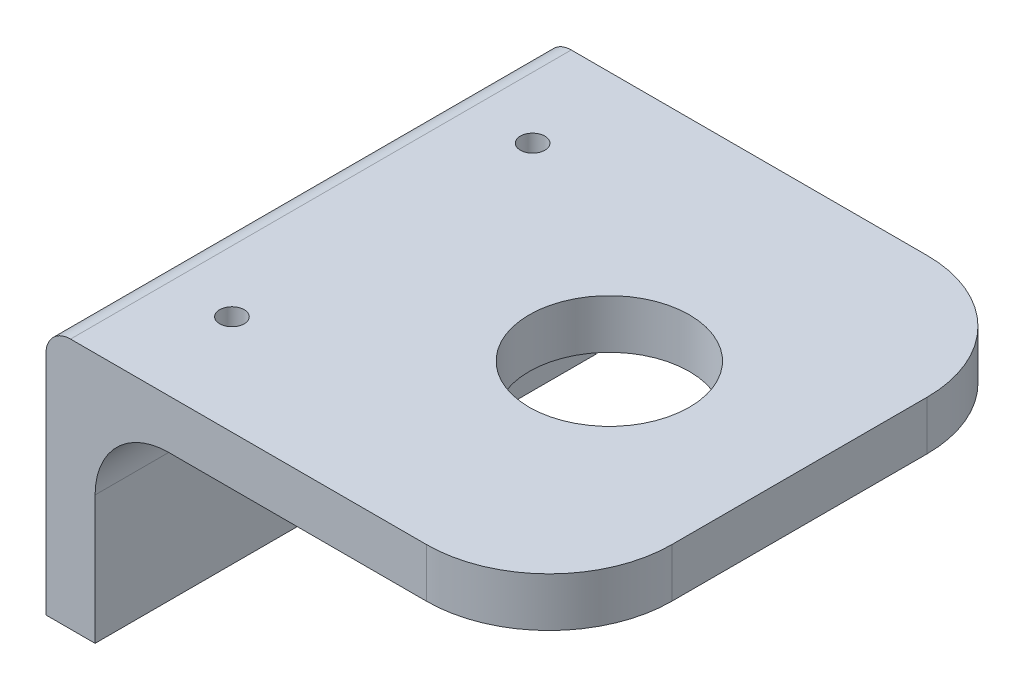
ISO-10303-21;
HEADER;
FILE_DESCRIPTION(('STEP AP214'),'2;1');
FILE_NAME('part.step','',(''),(''),'','','');
FILE_SCHEMA(('AUTOMOTIVE_DESIGN { 1 0 10303 214 1 1 1 1 }'));
ENDSEC;
DATA;
#1=APPLICATION_CONTEXT('core data for automotive mechanical design processes');
#2=APPLICATION_PROTOCOL_DEFINITION('international standard','automotive_design',2000,#1);
#3=PRODUCT_CONTEXT('',#1,'mechanical');
#4=PRODUCT('Part','Part','',(#3));
#5=PRODUCT_RELATED_PRODUCT_CATEGORY('part','',(#4));
#6=PRODUCT_DEFINITION_FORMATION('','',#4);
#7=PRODUCT_DEFINITION_CONTEXT('part definition',#1,'design');
#8=PRODUCT_DEFINITION('design','',#6,#7);
#9=PRODUCT_DEFINITION_SHAPE('','',#8);
#10=(LENGTH_UNIT() NAMED_UNIT(*) SI_UNIT(.MILLI.,.METRE.));
#11=(NAMED_UNIT(*) PLANE_ANGLE_UNIT() SI_UNIT($,.RADIAN.));
#12=(NAMED_UNIT(*) SI_UNIT($,.STERADIAN.) SOLID_ANGLE_UNIT());
#13=UNCERTAINTY_MEASURE_WITH_UNIT(LENGTH_MEASURE(1.E-05),#10,'distance_accuracy_value','');
#14=(GEOMETRIC_REPRESENTATION_CONTEXT(3) GLOBAL_UNCERTAINTY_ASSIGNED_CONTEXT((#13)) GLOBAL_UNIT_ASSIGNED_CONTEXT((#10,
#11,#12)) REPRESENTATION_CONTEXT('',''));
#15=CARTESIAN_POINT('',(0.,0.,0.));
#16=DIRECTION('',(0.,0.,1.));
#17=DIRECTION('',(1.,0.,0.));
#18=AXIS2_PLACEMENT_3D('',#15,#16,#17);
#19=CARTESIAN_POINT('',(0.,40.95,0.));
#20=DIRECTION('',(0.,1.,0.));
#21=DIRECTION('',(0.,0.,1.));
#22=AXIS2_PLACEMENT_3D('',#19,#20,#21);
#23=PLANE('',#22);
#24=DIRECTION('',(0.,0.,1.));
#25=VECTOR('',#24,1.);
#26=CARTESIAN_POINT('',(-41.,40.95,40.8));
#27=LINE('',#26,#25);
#28=CARTESIAN_POINT('',(-41.,40.95,-40.8));
#29=VERTEX_POINT('',#28);
#30=CARTESIAN_POINT('',(-41.,40.95,40.8));
#31=VERTEX_POINT('',#30);
#32=EDGE_CURVE('E44',#29,#31,#27,.T.);
#33=ORIENTED_EDGE('',*,*,#32,.F.);
#34=DIRECTION('',(-1.,0.,0.));
#35=VECTOR('',#34,1.);
#36=CARTESIAN_POINT('',(41.,40.95,-40.8));
#37=LINE('',#36,#35);
#38=CARTESIAN_POINT('',(-33.,40.95,-40.8));
#39=VERTEX_POINT('',#38);
#40=EDGE_CURVE('E57',#39,#29,#37,.T.);
#41=ORIENTED_EDGE('',*,*,#40,.F.);
#42=DIRECTION('',(0.,0.,-1.));
#43=VECTOR('',#42,1.);
#44=CARTESIAN_POINT('',(-33.,40.95,40.8));
#45=LINE('',#44,#43);
#46=CARTESIAN_POINT('',(-33.,40.95,40.8));
#47=VERTEX_POINT('',#46);
#48=EDGE_CURVE('E195',#47,#39,#45,.T.);
#49=ORIENTED_EDGE('',*,*,#48,.F.);
#50=DIRECTION('',(1.,0.,0.));
#51=VECTOR('',#50,1.);
#52=CARTESIAN_POINT('',(41.,40.95,40.8));
#53=LINE('',#52,#51);
#54=EDGE_CURVE('E11',#31,#47,#53,.T.);
#55=ORIENTED_EDGE('',*,*,#54,.F.);
#56=EDGE_LOOP('',(#33,#41,#49,#55));
#57=FACE_BOUND('',#56,.T.);
#58=ADVANCED_FACE('F37',(#57),#23,.F.);
#59=CARTESIAN_POINT('',(0.,73.9,0.));
#60=DIRECTION('',(0.,1.,0.));
#61=DIRECTION('',(0.,0.,1.));
#62=AXIS2_PLACEMENT_3D('',#59,#60,#61);
#63=PLANE('',#62);
#64=CARTESIAN_POINT('',(-27.,73.9,24.5));
#65=DIRECTION('',(0.,1.,0.));
#66=DIRECTION('',(0.,0.,1.));
#67=AXIS2_PLACEMENT_3D('',#64,#65,#66);
#68=CIRCLE('',#67,2.);
#69=CARTESIAN_POINT('',(-27.,73.9,26.5));
#70=VERTEX_POINT('',#69);
#71=EDGE_CURVE('E238',#70,#70,#68,.T.);
#72=ORIENTED_EDGE('',*,*,#71,.T.);
#73=EDGE_LOOP('',(#72));
#74=FACE_BOUND('',#73,.T.);
#75=ADVANCED_FACE('F275',(#74),#63,.T.);
#76=CARTESIAN_POINT('',(0.,73.9,0.));
#77=DIRECTION('',(0.,1.,0.));
#78=DIRECTION('',(0.,0.,1.));
#79=AXIS2_PLACEMENT_3D('',#76,#77,#78);
#80=PLANE('',#79);
#81=CARTESIAN_POINT('',(-27.,73.9,-24.5));
#82=DIRECTION('',(0.,1.,0.));
#83=DIRECTION('',(0.,0.,1.));
#84=AXIS2_PLACEMENT_3D('',#81,#82,#83);
#85=CIRCLE('',#84,2.);
#86=CARTESIAN_POINT('',(-27.,73.9,-22.5));
#87=VERTEX_POINT('',#86);
#88=EDGE_CURVE('E233',#87,#87,#85,.T.);
#89=ORIENTED_EDGE('',*,*,#88,.T.);
#90=EDGE_LOOP('',(#89));
#91=FACE_BOUND('',#90,.T.);
#92=ADVANCED_FACE('F279',(#91),#80,.T.);
#93=CARTESIAN_POINT('',(41.,81.9,40.8));
#94=DIRECTION('',(-1.,0.,0.));
#95=DIRECTION('',(0.,0.,1.));
#96=AXIS2_PLACEMENT_3D('',#93,#94,#95);
#97=PLANE('',#96);
#98=DIRECTION('',(0.,0.,-1.));
#99=VECTOR('',#98,1.);
#100=CARTESIAN_POINT('',(41.,81.9,40.8));
#101=LINE('',#100,#99);
#102=CARTESIAN_POINT('',(41.,81.9,20.8));
#103=VERTEX_POINT('',#102);
#104=CARTESIAN_POINT('',(41.,81.9,-20.8));
#105=VERTEX_POINT('',#104);
#106=EDGE_CURVE('E226',#103,#105,#101,.T.);
#107=ORIENTED_EDGE('',*,*,#106,.F.);
#108=DIRECTION('',(0.,-1.,0.));
#109=VECTOR('',#108,1.);
#110=CARTESIAN_POINT('',(41.,81.9,20.8));
#111=LINE('',#110,#109);
#112=CARTESIAN_POINT('',(41.,73.9,20.8));
#113=VERTEX_POINT('',#112);
#114=EDGE_CURVE('E172',#103,#113,#111,.T.);
#115=ORIENTED_EDGE('',*,*,#114,.T.);
#116=DIRECTION('',(0.,0.,-1.));
#117=VECTOR('',#116,1.);
#118=CARTESIAN_POINT('',(41.,73.9,40.8));
#119=LINE('',#118,#117);
#120=CARTESIAN_POINT('',(41.,73.9,-20.8));
#121=VERTEX_POINT('',#120);
#122=EDGE_CURVE('E217',#113,#121,#119,.T.);
#123=ORIENTED_EDGE('',*,*,#122,.T.);
#124=DIRECTION('',(0.,-1.,0.));
#125=VECTOR('',#124,1.);
#126=CARTESIAN_POINT('',(41.,81.9,-20.8));
#127=LINE('',#126,#125);
#128=EDGE_CURVE('E170',#121,#105,#127,.F.);
#129=ORIENTED_EDGE('',*,*,#128,.T.);
#130=EDGE_LOOP('',(#107,#115,#123,#129));
#131=FACE_BOUND('',#130,.T.);
#132=ADVANCED_FACE('F290',(#131),#97,.F.);
#133=CARTESIAN_POINT('',(10.,81.901,0.));
#134=DIRECTION('',(0.,-1.,0.));
#135=DIRECTION('',(0.,0.,-1.));
#136=AXIS2_PLACEMENT_3D('',#133,#134,#135);
#137=CYLINDRICAL_SURFACE('',#136,13.05);
#138=CARTESIAN_POINT('',(10.,81.9,0.));
#139=DIRECTION('',(0.,1.,0.));
#140=DIRECTION('',(0.,0.,1.));
#141=AXIS2_PLACEMENT_3D('',#138,#139,#140);
#142=CIRCLE('',#141,13.05);
#143=CARTESIAN_POINT('',(10.,81.9,13.05));
#144=VERTEX_POINT('',#143);
#145=EDGE_CURVE('E230',#144,#144,#142,.F.);
#146=ORIENTED_EDGE('',*,*,#145,.F.);
#147=EDGE_LOOP('',(#146));
#148=FACE_BOUND('',#147,.T.);
#149=CARTESIAN_POINT('',(10.,73.9,0.));
#150=DIRECTION('',(0.,-1.,0.));
#151=DIRECTION('',(0.,0.,-1.));
#152=AXIS2_PLACEMENT_3D('',#149,#150,#151);
#153=CIRCLE('',#152,13.05);
#154=CARTESIAN_POINT('',(10.,73.9,-13.05));
#155=VERTEX_POINT('',#154);
#156=EDGE_CURVE('E223',#155,#155,#153,.T.);
#157=ORIENTED_EDGE('',*,*,#156,.T.);
#158=EDGE_LOOP('',(#157));
#159=FACE_BOUND('',#158,.T.);
#160=ADVANCED_FACE('F330',(#148,#159),#137,.F.);
#161=CARTESIAN_POINT('',(-27.,73.9,24.5));
#162=DIRECTION('',(0.,1.,0.));
#163=DIRECTION('',(0.,0.,1.));
#164=AXIS2_PLACEMENT_3D('',#161,#162,#163);
#165=CYLINDRICAL_SURFACE('',#164,2.);
#166=ORIENTED_EDGE('',*,*,#71,.F.);
#167=EDGE_LOOP('',(#166));
#168=FACE_BOUND('',#167,.T.);
#169=CARTESIAN_POINT('',(-27.,81.9,24.5));
#170=DIRECTION('',(0.,1.,0.));
#171=DIRECTION('',(0.,0.,1.));
#172=AXIS2_PLACEMENT_3D('',#169,#170,#171);
#173=CIRCLE('',#172,2.);
#174=CARTESIAN_POINT('',(-27.,81.9,26.5));
#175=VERTEX_POINT('',#174);
#176=EDGE_CURVE('E141',#175,#175,#173,.T.);
#177=ORIENTED_EDGE('',*,*,#176,.T.);
#178=EDGE_LOOP('',(#177));
#179=FACE_BOUND('',#178,.T.);
#180=ADVANCED_FACE('F335',(#168,#179),#165,.F.);
#181=CARTESIAN_POINT('',(-27.,73.9,-24.5));
#182=DIRECTION('',(0.,1.,0.));
#183=DIRECTION('',(0.,0.,1.));
#184=AXIS2_PLACEMENT_3D('',#181,#182,#183);
#185=CYLINDRICAL_SURFACE('',#184,2.);
#186=ORIENTED_EDGE('',*,*,#88,.F.);
#187=EDGE_LOOP('',(#186));
#188=FACE_BOUND('',#187,.T.);
#189=CARTESIAN_POINT('',(-27.,81.9,-24.5));
#190=DIRECTION('',(0.,1.,0.));
#191=DIRECTION('',(0.,0.,1.));
#192=AXIS2_PLACEMENT_3D('',#189,#190,#191);
#193=CIRCLE('',#192,2.);
#194=CARTESIAN_POINT('',(-27.,81.9,-22.5));
#195=VERTEX_POINT('',#194);
#196=EDGE_CURVE('E241',#195,#195,#193,.T.);
#197=ORIENTED_EDGE('',*,*,#196,.T.);
#198=EDGE_LOOP('',(#197));
#199=FACE_BOUND('',#198,.T.);
#200=ADVANCED_FACE('F342',(#188,#199),#185,.F.);
#201=CARTESIAN_POINT('',(-33.,60.95,-25.));
#202=DIRECTION('',(-1.,0.,0.));
#203=DIRECTION('',(0.,0.,1.));
#204=AXIS2_PLACEMENT_3D('',#201,#202,#203);
#205=PLANE('',#204);
#206=CARTESIAN_POINT('',(-33.,60.95,-25.));
#207=DIRECTION('',(-1.,0.,0.));
#208=DIRECTION('',(0.,0.,1.));
#209=AXIS2_PLACEMENT_3D('',#206,#207,#208);
#210=CIRCLE('',#209,2.);
#211=CARTESIAN_POINT('',(-33.,61.9,-23.2400284093202));
#212=VERTEX_POINT('',#211);
#213=CARTESIAN_POINT('',(-33.,61.9,-26.7599715906798));
#214=VERTEX_POINT('',#213);
#215=EDGE_CURVE('E127',#212,#214,#210,.T.);
#216=ORIENTED_EDGE('',*,*,#215,.T.);
#217=DIRECTION('',(0.,0.,-1.));
#218=VECTOR('',#217,1.);
#219=CARTESIAN_POINT('',(-33.,61.9,40.8));
#220=LINE('',#219,#218);
#221=EDGE_CURVE('E124',#214,#212,#220,.F.);
#222=ORIENTED_EDGE('',*,*,#221,.T.);
#223=EDGE_LOOP('',(#216,#222));
#224=FACE_BOUND('',#223,.T.);
#225=ADVANCED_FACE('F126',(#224),#205,.T.);
#226=CARTESIAN_POINT('',(-33.,60.95,25.));
#227=DIRECTION('',(1.,0.,0.));
#228=DIRECTION('',(0.,0.,-1.));
#229=AXIS2_PLACEMENT_3D('',#226,#227,#228);
#230=PLANE('',#229);
#231=CARTESIAN_POINT('',(-33.,60.95,25.));
#232=DIRECTION('',(-1.,0.,0.));
#233=DIRECTION('',(0.,0.,-1.));
#234=AXIS2_PLACEMENT_3D('',#231,#232,#233);
#235=CIRCLE('',#234,2.);
#236=CARTESIAN_POINT('',(-33.,61.9,26.7599715906798));
#237=VERTEX_POINT('',#236);
#238=CARTESIAN_POINT('',(-33.,61.9,23.2400284093202));
#239=VERTEX_POINT('',#238);
#240=EDGE_CURVE('E249',#237,#239,#235,.T.);
#241=ORIENTED_EDGE('',*,*,#240,.T.);
#242=EDGE_CURVE('E154',#239,#237,#220,.F.);
#243=ORIENTED_EDGE('',*,*,#242,.T.);
#244=EDGE_LOOP('',(#241,#243));
#245=FACE_BOUND('',#244,.T.);
#246=ADVANCED_FACE('F298',(#245),#230,.F.);
#247=CARTESIAN_POINT('',(21.,81.9,20.8));
#248=DIRECTION('',(0.,-1.,0.));
#249=DIRECTION('',(0.,0.,-1.));
#250=AXIS2_PLACEMENT_3D('',#247,#248,#249);
#251=CYLINDRICAL_SURFACE('',#250,20.);
#252=CARTESIAN_POINT('',(21.,81.9,20.8));
#253=DIRECTION('',(0.,1.,0.));
#254=DIRECTION('',(0.,0.,1.));
#255=AXIS2_PLACEMENT_3D('',#252,#253,#254);
#256=CIRCLE('',#255,20.);
#257=CARTESIAN_POINT('',(21.,81.9,40.8));
#258=VERTEX_POINT('',#257);
#259=EDGE_CURVE('E184',#258,#103,#256,.T.);
#260=ORIENTED_EDGE('',*,*,#259,.F.);
#261=DIRECTION('',(0.,-1.,0.));
#262=VECTOR('',#261,1.);
#263=CARTESIAN_POINT('',(21.,8.,40.8));
#264=LINE('',#263,#262);
#265=CARTESIAN_POINT('',(21.,73.9,40.8));
#266=VERTEX_POINT('',#265);
#267=EDGE_CURVE('E179',#266,#258,#264,.F.);
#268=ORIENTED_EDGE('',*,*,#267,.F.);
#269=CARTESIAN_POINT('',(21.,73.9,20.8));
#270=DIRECTION('',(0.,1.,0.));
#271=DIRECTION('',(0.,0.,1.));
#272=AXIS2_PLACEMENT_3D('',#269,#270,#271);
#273=CIRCLE('',#272,20.);
#274=EDGE_CURVE('E177',#113,#266,#273,.F.);
#275=ORIENTED_EDGE('',*,*,#274,.F.);
#276=ORIENTED_EDGE('',*,*,#114,.F.);
#277=EDGE_LOOP('',(#260,#268,#275,#276));
#278=FACE_BOUND('',#277,.T.);
#279=ADVANCED_FACE('F294',(#278),#251,.T.);
#280=CARTESIAN_POINT('',(0.,73.9,0.));
#281=DIRECTION('',(0.,1.,0.));
#282=DIRECTION('',(0.,0.,1.));
#283=AXIS2_PLACEMENT_3D('',#280,#281,#282);
#284=PLANE('',#283);
#285=ORIENTED_EDGE('',*,*,#156,.F.);
#286=EDGE_LOOP('',(#285));
#287=FACE_BOUND('',#286,.T.);
#288=ORIENTED_EDGE('',*,*,#122,.F.);
#289=ORIENTED_EDGE('',*,*,#274,.T.);
#290=DIRECTION('',(1.,0.,0.));
#291=VECTOR('',#290,1.);
#292=CARTESIAN_POINT('',(41.,73.9,40.8));
#293=LINE('',#292,#291);
#294=CARTESIAN_POINT('',(-21.,73.9,40.8));
#295=VERTEX_POINT('',#294);
#296=EDGE_CURVE('E220',#295,#266,#293,.T.);
#297=ORIENTED_EDGE('',*,*,#296,.F.);
#298=DIRECTION('',(0.,0.,-1.));
#299=VECTOR('',#298,1.);
#300=CARTESIAN_POINT('',(-21.,73.9,-40.8));
#301=LINE('',#300,#299);
#302=CARTESIAN_POINT('',(-21.,73.9,-40.8));
#303=VERTEX_POINT('',#302);
#304=EDGE_CURVE('E158',#295,#303,#301,.T.);
#305=ORIENTED_EDGE('',*,*,#304,.T.);
#306=DIRECTION('',(-1.,0.,0.));
#307=VECTOR('',#306,1.);
#308=CARTESIAN_POINT('',(41.,73.9,-40.8));
#309=LINE('',#308,#307);
#310=CARTESIAN_POINT('',(21.,73.9,-40.8));
#311=VERTEX_POINT('',#310);
#312=EDGE_CURVE('E214',#311,#303,#309,.T.);
#313=ORIENTED_EDGE('',*,*,#312,.F.);
#314=CARTESIAN_POINT('',(21.,73.9,-20.8));
#315=DIRECTION('',(0.,1.,0.));
#316=DIRECTION('',(0.,0.,1.));
#317=AXIS2_PLACEMENT_3D('',#314,#315,#316);
#318=CIRCLE('',#317,20.);
#319=EDGE_CURVE('E175',#311,#121,#318,.F.);
#320=ORIENTED_EDGE('',*,*,#319,.T.);
#321=EDGE_LOOP('',(#288,#289,#297,#305,#313,#320));
#322=FACE_BOUND('',#321,.T.);
#323=ADVANCED_FACE('F297',(#287,#322),#284,.F.);
#324=CARTESIAN_POINT('',(21.,8.,-20.8));
#325=DIRECTION('',(0.,-1.,0.));
#326=DIRECTION('',(0.,0.,-1.));
#327=AXIS2_PLACEMENT_3D('',#324,#325,#326);
#328=CYLINDRICAL_SURFACE('',#327,20.);
#329=CARTESIAN_POINT('',(21.,81.9,-20.8));
#330=DIRECTION('',(0.,1.,0.));
#331=DIRECTION('',(0.,0.,1.));
#332=AXIS2_PLACEMENT_3D('',#329,#330,#331);
#333=CIRCLE('',#332,20.);
#334=CARTESIAN_POINT('',(21.,81.9,-40.8));
#335=VERTEX_POINT('',#334);
#336=EDGE_CURVE('E182',#105,#335,#333,.T.);
#337=ORIENTED_EDGE('',*,*,#336,.F.);
#338=ORIENTED_EDGE('',*,*,#128,.F.);
#339=ORIENTED_EDGE('',*,*,#319,.F.);
#340=DIRECTION('',(0.,-1.,0.));
#341=VECTOR('',#340,1.);
#342=CARTESIAN_POINT('',(21.,8.,-40.8));
#343=LINE('',#342,#341);
#344=EDGE_CURVE('E167',#335,#311,#343,.T.);
#345=ORIENTED_EDGE('',*,*,#344,.F.);
#346=EDGE_LOOP('',(#337,#338,#339,#345));
#347=FACE_BOUND('',#346,.T.);
#348=ADVANCED_FACE('F300',(#347),#328,.T.);
#349=CARTESIAN_POINT('',(0.,81.9,0.));
#350=DIRECTION('',(0.,1.,0.));
#351=DIRECTION('',(0.,0.,1.));
#352=AXIS2_PLACEMENT_3D('',#349,#350,#351);
#353=PLANE('',#352);
#354=ORIENTED_EDGE('',*,*,#196,.F.);
#355=EDGE_LOOP('',(#354));
#356=FACE_BOUND('',#355,.T.);
#357=ORIENTED_EDGE('',*,*,#176,.F.);
#358=EDGE_LOOP('',(#357));
#359=FACE_BOUND('',#358,.T.);
#360=ORIENTED_EDGE('',*,*,#145,.T.);
#361=EDGE_LOOP('',(#360));
#362=FACE_BOUND('',#361,.T.);
#363=DIRECTION('',(-1.,0.,0.));
#364=VECTOR('',#363,1.);
#365=CARTESIAN_POINT('',(41.,81.9,-40.8));
#366=LINE('',#365,#364);
#367=CARTESIAN_POINT('',(-37.,81.9,-40.8));
#368=VERTEX_POINT('',#367);
#369=EDGE_CURVE('E213',#335,#368,#366,.T.);
#370=ORIENTED_EDGE('',*,*,#369,.T.);
#371=DIRECTION('',(0.,0.,1.));
#372=VECTOR('',#371,1.);
#373=CARTESIAN_POINT('',(-37.,81.9,40.8));
#374=LINE('',#373,#372);
#375=CARTESIAN_POINT('',(-37.,81.9,40.8));
#376=VERTEX_POINT('',#375);
#377=EDGE_CURVE('E192',#368,#376,#374,.T.);
#378=ORIENTED_EDGE('',*,*,#377,.T.);
#379=DIRECTION('',(1.,0.,0.));
#380=VECTOR('',#379,1.);
#381=CARTESIAN_POINT('',(41.,81.9,40.8));
#382=LINE('',#381,#380);
#383=EDGE_CURVE('E216',#376,#258,#382,.T.);
#384=ORIENTED_EDGE('',*,*,#383,.T.);
#385=ORIENTED_EDGE('',*,*,#259,.T.);
#386=ORIENTED_EDGE('',*,*,#106,.T.);
#387=ORIENTED_EDGE('',*,*,#336,.T.);
#388=EDGE_LOOP('',(#370,#378,#384,#385,#386,#387));
#389=FACE_BOUND('',#388,.T.);
#390=ADVANCED_FACE('F302',(#356,#359,#362,#389),#353,.T.);
#391=CARTESIAN_POINT('',(-37.,77.9,0.));
#392=DIRECTION('',(0.,0.,-1.));
#393=DIRECTION('',(-1.,0.,0.));
#394=AXIS2_PLACEMENT_3D('',#391,#392,#393);
#395=CYLINDRICAL_SURFACE('',#394,4.);
#396=CARTESIAN_POINT('',(-37.,77.9,-40.8));
#397=DIRECTION('',(0.,0.,1.));
#398=DIRECTION('',(1.,0.,0.));
#399=AXIS2_PLACEMENT_3D('',#396,#397,#398);
#400=CIRCLE('',#399,4.);
#401=CARTESIAN_POINT('',(-41.,77.9,-40.8));
#402=VERTEX_POINT('',#401);
#403=EDGE_CURVE('E190',#402,#368,#400,.F.);
#404=ORIENTED_EDGE('',*,*,#403,.F.);
#405=DIRECTION('',(0.,0.,1.));
#406=VECTOR('',#405,1.);
#407=CARTESIAN_POINT('',(-41.,77.9,-40.8));
#408=LINE('',#407,#406);
#409=CARTESIAN_POINT('',(-41.,77.9,40.8));
#410=VERTEX_POINT('',#409);
#411=EDGE_CURVE('E186',#410,#402,#408,.F.);
#412=ORIENTED_EDGE('',*,*,#411,.F.);
#413=CARTESIAN_POINT('',(-37.,77.9,40.8));
#414=DIRECTION('',(0.,0.,-1.));
#415=DIRECTION('',(-1.,0.,0.));
#416=AXIS2_PLACEMENT_3D('',#413,#414,#415);
#417=CIRCLE('',#416,4.);
#418=EDGE_CURVE('E188',#376,#410,#417,.F.);
#419=ORIENTED_EDGE('',*,*,#418,.F.);
#420=ORIENTED_EDGE('',*,*,#377,.F.);
#421=EDGE_LOOP('',(#404,#412,#419,#420));
#422=FACE_BOUND('',#421,.T.);
#423=ADVANCED_FACE('F259',(#422),#395,.T.);
#424=CARTESIAN_POINT('',(-41.,8.,40.8));
#425=DIRECTION('',(1.,0.,0.));
#426=DIRECTION('',(0.,0.,-1.));
#427=AXIS2_PLACEMENT_3D('',#424,#425,#426);
#428=PLANE('',#427);
#429=CARTESIAN_POINT('',(-41.,60.95,25.));
#430=DIRECTION('',(-1.,0.,0.));
#431=DIRECTION('',(0.,0.,-1.));
#432=AXIS2_PLACEMENT_3D('',#429,#430,#431);
#433=CIRCLE('',#432,2.);
#434=CARTESIAN_POINT('',(-41.,60.95,23.));
#435=VERTEX_POINT('',#434);
#436=EDGE_CURVE('E247',#435,#435,#433,.T.);
#437=ORIENTED_EDGE('',*,*,#436,.F.);
#438=EDGE_LOOP('',(#437));
#439=FACE_BOUND('',#438,.T.);
#440=CARTESIAN_POINT('',(-41.,60.95,-25.));
#441=DIRECTION('',(-1.,0.,0.));
#442=DIRECTION('',(0.,0.,1.));
#443=AXIS2_PLACEMENT_3D('',#440,#441,#442);
#444=CIRCLE('',#443,2.);
#445=CARTESIAN_POINT('',(-41.,60.95,-23.));
#446=VERTEX_POINT('',#445);
#447=EDGE_CURVE('E149',#446,#446,#444,.T.);
#448=ORIENTED_EDGE('',*,*,#447,.F.);
#449=EDGE_LOOP('',(#448));
#450=FACE_BOUND('',#449,.T.);
#451=DIRECTION('',(0.,-1.,0.));
#452=VECTOR('',#451,1.);
#453=CARTESIAN_POINT('',(-41.,8.,-40.8));
#454=LINE('',#453,#452);
#455=EDGE_CURVE('E203',#402,#29,#454,.T.);
#456=ORIENTED_EDGE('',*,*,#455,.T.);
#457=ORIENTED_EDGE('',*,*,#32,.T.);
#458=DIRECTION('',(0.,-1.,0.));
#459=VECTOR('',#458,1.);
#460=CARTESIAN_POINT('',(-41.,8.,40.8));
#461=LINE('',#460,#459);
#462=EDGE_CURVE('E159',#410,#31,#461,.T.);
#463=ORIENTED_EDGE('',*,*,#462,.F.);
#464=ORIENTED_EDGE('',*,*,#411,.T.);
#465=EDGE_LOOP('',(#456,#457,#463,#464));
#466=FACE_BOUND('',#465,.T.);
#467=ADVANCED_FACE('F201',(#439,#450,#466),#428,.F.);
#468=CARTESIAN_POINT('',(-33.,60.95,25.));
#469=DIRECTION('',(-1.,0.,0.));
#470=DIRECTION('',(0.,0.,1.));
#471=AXIS2_PLACEMENT_3D('',#468,#469,#470);
#472=CYLINDRICAL_SURFACE('',#471,2.);
#473=ORIENTED_EDGE('',*,*,#240,.F.);
#474=EDGE_CURVE('E251',#239,#237,#235,.T.);
#475=ORIENTED_EDGE('',*,*,#474,.F.);
#476=EDGE_LOOP('',(#473,#475));
#477=FACE_BOUND('',#476,.T.);
#478=ORIENTED_EDGE('',*,*,#436,.T.);
#479=EDGE_LOOP('',(#478));
#480=FACE_BOUND('',#479,.T.);
#481=ADVANCED_FACE('F255',(#477,#480),#472,.F.);
#482=CARTESIAN_POINT('',(-33.,60.95,-25.));
#483=DIRECTION('',(-1.,0.,0.));
#484=DIRECTION('',(0.,0.,1.));
#485=AXIS2_PLACEMENT_3D('',#482,#483,#484);
#486=CYLINDRICAL_SURFACE('',#485,2.);
#487=ORIENTED_EDGE('',*,*,#215,.F.);
#488=EDGE_CURVE('E140',#214,#212,#210,.T.);
#489=ORIENTED_EDGE('',*,*,#488,.F.);
#490=EDGE_LOOP('',(#487,#489));
#491=FACE_BOUND('',#490,.T.);
#492=ORIENTED_EDGE('',*,*,#447,.T.);
#493=EDGE_LOOP('',(#492));
#494=FACE_BOUND('',#493,.T.);
#495=ADVANCED_FACE('F138',(#491,#494),#486,.F.);
#496=CARTESIAN_POINT('',(-21.,61.9,0.));
#497=DIRECTION('',(0.,0.,1.));
#498=DIRECTION('',(1.,0.,0.));
#499=AXIS2_PLACEMENT_3D('',#496,#497,#498);
#500=CYLINDRICAL_SURFACE('',#499,12.);
#501=CARTESIAN_POINT('',(-21.,61.9,40.8));
#502=DIRECTION('',(0.,0.,-1.));
#503=DIRECTION('',(-1.,0.,0.));
#504=AXIS2_PLACEMENT_3D('',#501,#502,#503);
#505=CIRCLE('',#504,12.);
#506=CARTESIAN_POINT('',(-33.,61.9,40.8));
#507=VERTEX_POINT('',#506);
#508=EDGE_CURVE('E165',#507,#295,#505,.T.);
#509=ORIENTED_EDGE('',*,*,#508,.F.);
#510=EDGE_CURVE('E155',#237,#507,#220,.F.);
#511=ORIENTED_EDGE('',*,*,#510,.F.);
#512=ORIENTED_EDGE('',*,*,#242,.F.);
#513=EDGE_CURVE('E134',#212,#239,#220,.F.);
#514=ORIENTED_EDGE('',*,*,#513,.F.);
#515=ORIENTED_EDGE('',*,*,#221,.F.);
#516=CARTESIAN_POINT('',(-33.,61.9,-40.8));
#517=VERTEX_POINT('',#516);
#518=EDGE_CURVE('E133',#517,#214,#220,.F.);
#519=ORIENTED_EDGE('',*,*,#518,.F.);
#520=CARTESIAN_POINT('',(-21.,61.9,-40.8));
#521=DIRECTION('',(0.,0.,1.));
#522=DIRECTION('',(1.,0.,0.));
#523=AXIS2_PLACEMENT_3D('',#520,#521,#522);
#524=CIRCLE('',#523,12.);
#525=EDGE_CURVE('E163',#303,#517,#524,.T.);
#526=ORIENTED_EDGE('',*,*,#525,.F.);
#527=ORIENTED_EDGE('',*,*,#304,.F.);
#528=EDGE_LOOP('',(#509,#511,#512,#514,#515,#519,#526,#527));
#529=FACE_BOUND('',#528,.T.);
#530=ADVANCED_FACE('F152',(#529),#500,.F.);
#531=CARTESIAN_POINT('',(41.,8.,-40.8));
#532=DIRECTION('',(0.,0.,1.));
#533=DIRECTION('',(1.,0.,0.));
#534=AXIS2_PLACEMENT_3D('',#531,#532,#533);
#535=PLANE('',#534);
#536=DIRECTION('',(0.,-1.,0.));
#537=VECTOR('',#536,1.);
#538=CARTESIAN_POINT('',(-33.,60.9,-40.8));
#539=LINE('',#538,#537);
#540=EDGE_CURVE('E209',#517,#39,#539,.T.);
#541=ORIENTED_EDGE('',*,*,#540,.T.);
#542=ORIENTED_EDGE('',*,*,#40,.T.);
#543=ORIENTED_EDGE('',*,*,#455,.F.);
#544=ORIENTED_EDGE('',*,*,#403,.T.);
#545=ORIENTED_EDGE('',*,*,#369,.F.);
#546=ORIENTED_EDGE('',*,*,#344,.T.);
#547=ORIENTED_EDGE('',*,*,#312,.T.);
#548=ORIENTED_EDGE('',*,*,#525,.T.);
#549=EDGE_LOOP('',(#541,#542,#543,#544,#545,#546,#547,#548));
#550=FACE_BOUND('',#549,.T.);
#551=ADVANCED_FACE('F268',(#550),#535,.F.);
#552=CARTESIAN_POINT('',(41.,8.,40.8));
#553=DIRECTION('',(0.,0.,-1.));
#554=DIRECTION('',(-1.,0.,0.));
#555=AXIS2_PLACEMENT_3D('',#552,#553,#554);
#556=PLANE('',#555);
#557=ORIENTED_EDGE('',*,*,#462,.T.);
#558=ORIENTED_EDGE('',*,*,#54,.T.);
#559=DIRECTION('',(0.,-1.,0.));
#560=VECTOR('',#559,1.);
#561=CARTESIAN_POINT('',(-33.,60.9,40.8));
#562=LINE('',#561,#560);
#563=EDGE_CURVE('E208',#507,#47,#562,.T.);
#564=ORIENTED_EDGE('',*,*,#563,.F.);
#565=ORIENTED_EDGE('',*,*,#508,.T.);
#566=ORIENTED_EDGE('',*,*,#296,.T.);
#567=ORIENTED_EDGE('',*,*,#267,.T.);
#568=ORIENTED_EDGE('',*,*,#383,.F.);
#569=ORIENTED_EDGE('',*,*,#418,.T.);
#570=EDGE_LOOP('',(#557,#558,#564,#565,#566,#567,#568,#569));
#571=FACE_BOUND('',#570,.T.);
#572=ADVANCED_FACE('F205',(#571),#556,.F.);
#573=CARTESIAN_POINT('',(-33.,60.9,40.8));
#574=DIRECTION('',(-1.,0.,0.));
#575=DIRECTION('',(0.,0.,1.));
#576=AXIS2_PLACEMENT_3D('',#573,#574,#575);
#577=PLANE('',#576);
#578=ORIENTED_EDGE('',*,*,#563,.T.);
#579=ORIENTED_EDGE('',*,*,#48,.T.);
#580=ORIENTED_EDGE('',*,*,#540,.F.);
#581=ORIENTED_EDGE('',*,*,#518,.T.);
#582=ORIENTED_EDGE('',*,*,#488,.T.);
#583=ORIENTED_EDGE('',*,*,#513,.T.);
#584=ORIENTED_EDGE('',*,*,#474,.T.);
#585=ORIENTED_EDGE('',*,*,#510,.T.);
#586=EDGE_LOOP('',(#578,#579,#580,#581,#582,#583,#584,#585));
#587=FACE_BOUND('',#586,.T.);
#588=ADVANCED_FACE('F146',(#587),#577,.F.);
#589=CLOSED_SHELL('',(#58,#75,#92,#132,#160,#180,#200,#225,#246,#279,#323,#348,#390,#423,#467,
#481,#495,#530,#551,#572,#588));
#590=MANIFOLD_SOLID_BREP('B2',#589);
#591=ADVANCED_BREP_SHAPE_REPRESENTATION('',(#18,#590),#14);
#592=SHAPE_DEFINITION_REPRESENTATION(#9,#591);
ENDSEC;
END-ISO-10303-21;
